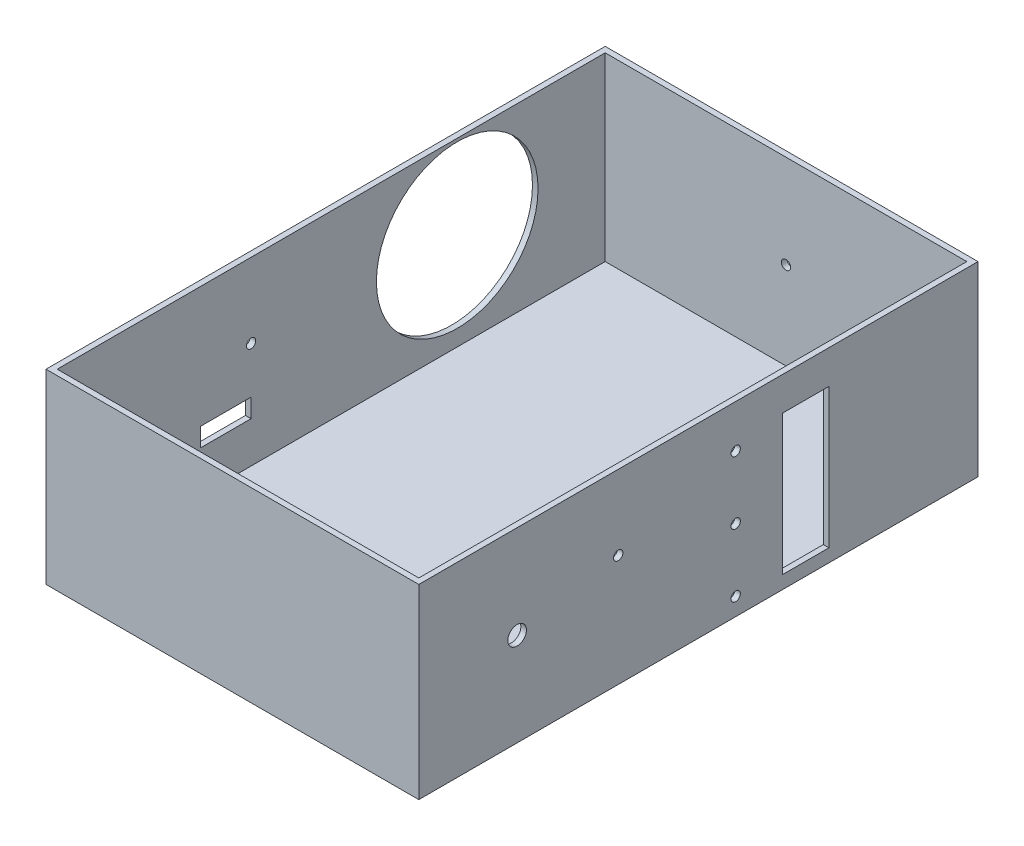
ISO-10303-21;
HEADER;
FILE_DESCRIPTION(('STEP AP214'),'2;1');
FILE_NAME('part.step','',(''),(''),'','','');
FILE_SCHEMA(('AUTOMOTIVE_DESIGN { 1 0 10303 214 1 1 1 1 }'));
ENDSEC;
DATA;
#1=APPLICATION_CONTEXT('core data for automotive mechanical design processes');
#2=APPLICATION_PROTOCOL_DEFINITION('international standard','automotive_design',2000,#1);
#3=PRODUCT_CONTEXT('',#1,'mechanical');
#4=PRODUCT('Part','Part','',(#3));
#5=PRODUCT_RELATED_PRODUCT_CATEGORY('part','',(#4));
#6=PRODUCT_DEFINITION_FORMATION('','',#4);
#7=PRODUCT_DEFINITION_CONTEXT('part definition',#1,'design');
#8=PRODUCT_DEFINITION('design','',#6,#7);
#9=PRODUCT_DEFINITION_SHAPE('','',#8);
#10=(LENGTH_UNIT() NAMED_UNIT(*) SI_UNIT(.MILLI.,.METRE.));
#11=(NAMED_UNIT(*) PLANE_ANGLE_UNIT() SI_UNIT($,.RADIAN.));
#12=(NAMED_UNIT(*) SI_UNIT($,.STERADIAN.) SOLID_ANGLE_UNIT());
#13=UNCERTAINTY_MEASURE_WITH_UNIT(LENGTH_MEASURE(1.E-05),#10,'distance_accuracy_value','');
#14=(GEOMETRIC_REPRESENTATION_CONTEXT(3) GLOBAL_UNCERTAINTY_ASSIGNED_CONTEXT((#13)) GLOBAL_UNIT_ASSIGNED_CONTEXT((#10,
#11,#12)) REPRESENTATION_CONTEXT('',''));
#15=CARTESIAN_POINT('',(0.,0.,0.));
#16=DIRECTION('',(0.,0.,1.));
#17=DIRECTION('',(1.,0.,0.));
#18=AXIS2_PLACEMENT_3D('',#15,#16,#17);
#19=CARTESIAN_POINT('',(-100.,50.,150.));
#20=DIRECTION('',(1.,0.,0.));
#21=DIRECTION('',(0.,0.,-1.));
#22=AXIS2_PLACEMENT_3D('',#19,#20,#21);
#23=PLANE('',#22);
#24=CARTESIAN_POINT('',(-100.,5.00000000000006,-67.6200595670859));
#25=DIRECTION('',(-1.,0.,0.));
#26=DIRECTION('',(0.,0.,1.));
#27=AXIS2_PLACEMENT_3D('',#24,#25,#26);
#28=CIRCLE('',#27,43.3583016473292);
#29=CARTESIAN_POINT('',(-100.,5.00000000000006,-24.2617579197568));
#30=VERTEX_POINT('',#29);
#31=EDGE_CURVE('E345',#30,#30,#28,.T.);
#32=ORIENTED_EDGE('',*,*,#31,.F.);
#33=EDGE_LOOP('',(#32));
#34=FACE_BOUND('',#33,.T.);
#35=CARTESIAN_POINT('',(-100.,10.,43.));
#36=DIRECTION('',(-1.,0.,0.));
#37=DIRECTION('',(0.,0.,1.));
#38=AXIS2_PLACEMENT_3D('',#35,#36,#37);
#39=CIRCLE('',#38,2.50000000000001);
#40=CARTESIAN_POINT('',(-100.,10.,45.5));
#41=VERTEX_POINT('',#40);
#42=EDGE_CURVE('E190',#41,#41,#39,.T.);
#43=ORIENTED_EDGE('',*,*,#42,.F.);
#44=EDGE_LOOP('',(#43));
#45=FACE_BOUND('',#44,.T.);
#46=DIRECTION('',(0.,0.,-1.));
#47=VECTOR('',#46,1.);
#48=CARTESIAN_POINT('',(-100.,-15.,43.));
#49=LINE('',#48,#47);
#50=CARTESIAN_POINT('',(-100.,-15.,70.));
#51=VERTEX_POINT('',#50);
#52=CARTESIAN_POINT('',(-100.,-15.,43.));
#53=VERTEX_POINT('',#52);
#54=EDGE_CURVE('E199',#51,#53,#49,.T.);
#55=ORIENTED_EDGE('',*,*,#54,.F.);
#56=DIRECTION('',(0.,1.,0.));
#57=VECTOR('',#56,1.);
#58=CARTESIAN_POINT('',(-100.,-15.,70.));
#59=LINE('',#58,#57);
#60=CARTESIAN_POINT('',(-100.,-25.,70.));
#61=VERTEX_POINT('',#60);
#62=EDGE_CURVE('E197',#61,#51,#59,.T.);
#63=ORIENTED_EDGE('',*,*,#62,.F.);
#64=DIRECTION('',(0.,0.,1.));
#65=VECTOR('',#64,1.);
#66=CARTESIAN_POINT('',(-100.,-25.,43.));
#67=LINE('',#66,#65);
#68=CARTESIAN_POINT('',(-100.,-25.,43.));
#69=VERTEX_POINT('',#68);
#70=EDGE_CURVE('E205',#69,#61,#67,.T.);
#71=ORIENTED_EDGE('',*,*,#70,.F.);
#72=DIRECTION('',(0.,-1.,0.));
#73=VECTOR('',#72,1.);
#74=CARTESIAN_POINT('',(-100.,-15.,43.));
#75=LINE('',#74,#73);
#76=EDGE_CURVE('E202',#53,#69,#75,.T.);
#77=ORIENTED_EDGE('',*,*,#76,.F.);
#78=EDGE_LOOP('',(#55,#63,#71,#77));
#79=FACE_BOUND('',#78,.T.);
#80=DIRECTION('',(0.,-1.,0.));
#81=VECTOR('',#80,1.);
#82=CARTESIAN_POINT('',(-100.,50.,-150.));
#83=LINE('',#82,#81);
#84=CARTESIAN_POINT('',(-100.,50.,-150.));
#85=VERTEX_POINT('',#84);
#86=CARTESIAN_POINT('',(-100.,-50.,-150.));
#87=VERTEX_POINT('',#86);
#88=EDGE_CURVE('E251',#85,#87,#83,.T.);
#89=ORIENTED_EDGE('',*,*,#88,.T.);
#90=DIRECTION('',(0.,0.,-1.));
#91=VECTOR('',#90,1.);
#92=CARTESIAN_POINT('',(-100.,-50.,150.));
#93=LINE('',#92,#91);
#94=CARTESIAN_POINT('',(-100.,-50.,150.));
#95=VERTEX_POINT('',#94);
#96=EDGE_CURVE('E284',#95,#87,#93,.T.);
#97=ORIENTED_EDGE('',*,*,#96,.F.);
#98=DIRECTION('',(0.,-1.,0.));
#99=VECTOR('',#98,1.);
#100=CARTESIAN_POINT('',(-100.,50.,150.));
#101=LINE('',#100,#99);
#102=CARTESIAN_POINT('',(-100.,50.,150.));
#103=VERTEX_POINT('',#102);
#104=EDGE_CURVE('E258',#103,#95,#101,.T.);
#105=ORIENTED_EDGE('',*,*,#104,.F.);
#106=DIRECTION('',(0.,0.,-1.));
#107=VECTOR('',#106,1.);
#108=CARTESIAN_POINT('',(-100.,50.,150.));
#109=LINE('',#108,#107);
#110=EDGE_CURVE('E268',#103,#85,#109,.T.);
#111=ORIENTED_EDGE('',*,*,#110,.T.);
#112=EDGE_LOOP('',(#89,#97,#105,#111));
#113=FACE_BOUND('',#112,.T.);
#114=ADVANCED_FACE('F35',(#34,#45,#79,#113),#23,.F.);
#115=CARTESIAN_POINT('',(-100.,-50.,150.));
#116=DIRECTION('',(0.,1.,0.));
#117=DIRECTION('',(0.,0.,1.));
#118=AXIS2_PLACEMENT_3D('',#115,#116,#117);
#119=PLANE('',#118);
#120=DIRECTION('',(1.,0.,0.));
#121=VECTOR('',#120,1.);
#122=CARTESIAN_POINT('',(-100.,-50.,-150.));
#123=LINE('',#122,#121);
#124=CARTESIAN_POINT('',(100.,-50.,-150.));
#125=VERTEX_POINT('',#124);
#126=EDGE_CURVE('E271',#87,#125,#123,.T.);
#127=ORIENTED_EDGE('',*,*,#126,.T.);
#128=DIRECTION('',(0.,0.,-1.));
#129=VECTOR('',#128,1.);
#130=CARTESIAN_POINT('',(100.,-50.,150.));
#131=LINE('',#130,#129);
#132=CARTESIAN_POINT('',(100.,-50.,150.));
#133=VERTEX_POINT('',#132);
#134=EDGE_CURVE('E281',#133,#125,#131,.T.);
#135=ORIENTED_EDGE('',*,*,#134,.F.);
#136=DIRECTION('',(1.,0.,0.));
#137=VECTOR('',#136,1.);
#138=CARTESIAN_POINT('',(-100.,-50.,150.));
#139=LINE('',#138,#137);
#140=EDGE_CURVE('E261',#95,#133,#139,.T.);
#141=ORIENTED_EDGE('',*,*,#140,.F.);
#142=ORIENTED_EDGE('',*,*,#96,.T.);
#143=EDGE_LOOP('',(#127,#135,#141,#142));
#144=FACE_BOUND('',#143,.T.);
#145=ADVANCED_FACE('F336',(#144),#119,.F.);
#146=CARTESIAN_POINT('',(100.,50.,150.));
#147=DIRECTION('',(-1.,0.,0.));
#148=DIRECTION('',(0.,0.,1.));
#149=AXIS2_PLACEMENT_3D('',#146,#147,#148);
#150=PLANE('',#149);
#151=DIRECTION('',(0.,0.,1.));
#152=VECTOR('',#151,1.);
#153=CARTESIAN_POINT('',(100.,32.,-45.));
#154=LINE('',#153,#152);
#155=CARTESIAN_POINT('',(100.,32.,-70.));
#156=VERTEX_POINT('',#155);
#157=CARTESIAN_POINT('',(100.,32.,-45.));
#158=VERTEX_POINT('',#157);
#159=EDGE_CURVE('E160',#156,#158,#154,.T.);
#160=ORIENTED_EDGE('',*,*,#159,.F.);
#161=DIRECTION('',(0.,1.,0.));
#162=VECTOR('',#161,1.);
#163=CARTESIAN_POINT('',(100.,32.,-70.));
#164=LINE('',#163,#162);
#165=CARTESIAN_POINT('',(100.,-43.,-70.));
#166=VERTEX_POINT('',#165);
#167=EDGE_CURVE('E50',#166,#156,#164,.T.);
#168=ORIENTED_EDGE('',*,*,#167,.F.);
#169=DIRECTION('',(0.,0.,-1.));
#170=VECTOR('',#169,1.);
#171=CARTESIAN_POINT('',(100.,-43.,-45.));
#172=LINE('',#171,#170);
#173=CARTESIAN_POINT('',(100.,-43.,-45.));
#174=VERTEX_POINT('',#173);
#175=EDGE_CURVE('E167',#174,#166,#172,.T.);
#176=ORIENTED_EDGE('',*,*,#175,.F.);
#177=DIRECTION('',(0.,-1.,0.));
#178=VECTOR('',#177,1.);
#179=CARTESIAN_POINT('',(100.,32.,-45.));
#180=LINE('',#179,#178);
#181=EDGE_CURVE('E151',#158,#174,#180,.T.);
#182=ORIENTED_EDGE('',*,*,#181,.F.);
#183=EDGE_LOOP('',(#160,#168,#176,#182));
#184=FACE_BOUND('',#183,.T.);
#185=CARTESIAN_POINT('',(100.,27.,-20.));
#186=DIRECTION('',(1.,0.,0.));
#187=DIRECTION('',(0.,0.,-1.));
#188=AXIS2_PLACEMENT_3D('',#185,#186,#187);
#189=CIRCLE('',#188,2.49999999999999);
#190=CARTESIAN_POINT('',(100.,27.,-22.5));
#191=VERTEX_POINT('',#190);
#192=EDGE_CURVE('E177',#191,#191,#189,.T.);
#193=ORIENTED_EDGE('',*,*,#192,.F.);
#194=EDGE_LOOP('',(#193));
#195=FACE_BOUND('',#194,.T.);
#196=CARTESIAN_POINT('',(100.,-6.75000000000002,-20.));
#197=DIRECTION('',(1.,0.,0.));
#198=DIRECTION('',(0.,0.,-1.));
#199=AXIS2_PLACEMENT_3D('',#196,#197,#198);
#200=CIRCLE('',#199,2.49999999999999);
#201=CARTESIAN_POINT('',(100.,-6.75000000000002,-22.5));
#202=VERTEX_POINT('',#201);
#203=EDGE_CURVE('E180',#202,#202,#200,.T.);
#204=ORIENTED_EDGE('',*,*,#203,.F.);
#205=EDGE_LOOP('',(#204));
#206=FACE_BOUND('',#205,.T.);
#207=CARTESIAN_POINT('',(100.,-40.5,-20.));
#208=DIRECTION('',(1.,0.,0.));
#209=DIRECTION('',(0.,0.,-1.));
#210=AXIS2_PLACEMENT_3D('',#207,#208,#209);
#211=CIRCLE('',#210,2.5);
#212=CARTESIAN_POINT('',(100.,-40.5,-22.5));
#213=VERTEX_POINT('',#212);
#214=EDGE_CURVE('E183',#213,#213,#211,.T.);
#215=ORIENTED_EDGE('',*,*,#214,.F.);
#216=EDGE_LOOP('',(#215));
#217=FACE_BOUND('',#216,.T.);
#218=CARTESIAN_POINT('',(100.,10.,43.));
#219=DIRECTION('',(-1.,0.,0.));
#220=DIRECTION('',(0.,0.,1.));
#221=AXIS2_PLACEMENT_3D('',#218,#219,#220);
#222=CIRCLE('',#221,2.50000000000001);
#223=CARTESIAN_POINT('',(100.,10.,45.5));
#224=VERTEX_POINT('',#223);
#225=EDGE_CURVE('E186',#224,#224,#222,.T.);
#226=ORIENTED_EDGE('',*,*,#225,.T.);
#227=EDGE_LOOP('',(#226));
#228=FACE_BOUND('',#227,.T.);
#229=CARTESIAN_POINT('',(100.,0.,97.2561035240871));
#230=DIRECTION('',(1.,0.,0.));
#231=DIRECTION('',(0.,0.,-1.));
#232=AXIS2_PLACEMENT_3D('',#229,#230,#231);
#233=CIRCLE('',#232,5.);
#234=CARTESIAN_POINT('',(100.,0.,92.2561035240871));
#235=VERTEX_POINT('',#234);
#236=EDGE_CURVE('E221',#235,#235,#233,.T.);
#237=ORIENTED_EDGE('',*,*,#236,.F.);
#238=EDGE_LOOP('',(#237));
#239=FACE_BOUND('',#238,.T.);
#240=DIRECTION('',(0.,1.,0.));
#241=VECTOR('',#240,1.);
#242=CARTESIAN_POINT('',(100.,50.,-150.));
#243=LINE('',#242,#241);
#244=CARTESIAN_POINT('',(100.,50.,-150.));
#245=VERTEX_POINT('',#244);
#246=EDGE_CURVE('E273',#125,#245,#243,.T.);
#247=ORIENTED_EDGE('',*,*,#246,.T.);
#248=DIRECTION('',(0.,0.,-1.));
#249=VECTOR('',#248,1.);
#250=CARTESIAN_POINT('',(100.,50.,150.));
#251=LINE('',#250,#249);
#252=CARTESIAN_POINT('',(100.,50.,150.));
#253=VERTEX_POINT('',#252);
#254=EDGE_CURVE('E278',#253,#245,#251,.T.);
#255=ORIENTED_EDGE('',*,*,#254,.F.);
#256=DIRECTION('',(0.,1.,0.));
#257=VECTOR('',#256,1.);
#258=CARTESIAN_POINT('',(100.,50.,150.));
#259=LINE('',#258,#257);
#260=EDGE_CURVE('E264',#133,#253,#259,.T.);
#261=ORIENTED_EDGE('',*,*,#260,.F.);
#262=ORIENTED_EDGE('',*,*,#134,.T.);
#263=EDGE_LOOP('',(#247,#255,#261,#262));
#264=FACE_BOUND('',#263,.T.);
#265=ADVANCED_FACE('F164',(#184,#195,#206,#217,#228,#239,#264),#150,.F.);
#266=CARTESIAN_POINT('',(-100.,50.,150.));
#267=DIRECTION('',(0.,-1.,0.));
#268=DIRECTION('',(0.,0.,-1.));
#269=AXIS2_PLACEMENT_3D('',#266,#267,#268);
#270=PLANE('',#269);
#271=DIRECTION('',(1.,0.,0.));
#272=VECTOR('',#271,1.);
#273=CARTESIAN_POINT('',(-97.,50.,147.));
#274=LINE('',#273,#272);
#275=CARTESIAN_POINT('',(-97.,50.,147.));
#276=VERTEX_POINT('',#275);
#277=CARTESIAN_POINT('',(97.,50.,147.));
#278=VERTEX_POINT('',#277);
#279=EDGE_CURVE('E241',#276,#278,#274,.T.);
#280=ORIENTED_EDGE('',*,*,#279,.F.);
#281=DIRECTION('',(0.,0.,1.));
#282=VECTOR('',#281,1.);
#283=CARTESIAN_POINT('',(-97.,50.,-147.));
#284=LINE('',#283,#282);
#285=CARTESIAN_POINT('',(-97.,50.,-147.));
#286=VERTEX_POINT('',#285);
#287=EDGE_CURVE('E239',#286,#276,#284,.T.);
#288=ORIENTED_EDGE('',*,*,#287,.F.);
#289=DIRECTION('',(-1.,0.,0.));
#290=VECTOR('',#289,1.);
#291=CARTESIAN_POINT('',(-97.,50.,-147.));
#292=LINE('',#291,#290);
#293=CARTESIAN_POINT('',(97.,50.,-147.));
#294=VERTEX_POINT('',#293);
#295=EDGE_CURVE('E229',#294,#286,#292,.T.);
#296=ORIENTED_EDGE('',*,*,#295,.F.);
#297=DIRECTION('',(0.,0.,-1.));
#298=VECTOR('',#297,1.);
#299=CARTESIAN_POINT('',(97.,50.,-147.));
#300=LINE('',#299,#298);
#301=EDGE_CURVE('E244',#278,#294,#300,.T.);
#302=ORIENTED_EDGE('',*,*,#301,.F.);
#303=EDGE_LOOP('',(#280,#288,#296,#302));
#304=FACE_BOUND('',#303,.T.);
#305=DIRECTION('',(-1.,0.,0.));
#306=VECTOR('',#305,1.);
#307=CARTESIAN_POINT('',(-100.,50.,-150.));
#308=LINE('',#307,#306);
#309=EDGE_CURVE('E262',#245,#85,#308,.T.);
#310=ORIENTED_EDGE('',*,*,#309,.T.);
#311=ORIENTED_EDGE('',*,*,#110,.F.);
#312=DIRECTION('',(-1.,0.,0.));
#313=VECTOR('',#312,1.);
#314=CARTESIAN_POINT('',(-100.,50.,150.));
#315=LINE('',#314,#313);
#316=EDGE_CURVE('E266',#253,#103,#315,.T.);
#317=ORIENTED_EDGE('',*,*,#316,.F.);
#318=ORIENTED_EDGE('',*,*,#254,.T.);
#319=EDGE_LOOP('',(#310,#311,#317,#318));
#320=FACE_BOUND('',#319,.T.);
#321=ADVANCED_FACE('F367',(#304,#320),#270,.F.);
#322=CARTESIAN_POINT('',(0.,0.,150.));
#323=DIRECTION('',(0.,0.,1.));
#324=DIRECTION('',(1.,0.,0.));
#325=AXIS2_PLACEMENT_3D('',#322,#323,#324);
#326=PLANE('',#325);
#327=ORIENTED_EDGE('',*,*,#104,.T.);
#328=ORIENTED_EDGE('',*,*,#140,.T.);
#329=ORIENTED_EDGE('',*,*,#260,.T.);
#330=ORIENTED_EDGE('',*,*,#316,.T.);
#331=EDGE_LOOP('',(#327,#328,#329,#330));
#332=FACE_BOUND('',#331,.T.);
#333=ADVANCED_FACE('F363',(#332),#326,.T.);
#334=CARTESIAN_POINT('',(0.,0.,-150.));
#335=DIRECTION('',(0.,0.,1.));
#336=DIRECTION('',(1.,0.,0.));
#337=AXIS2_PLACEMENT_3D('',#334,#335,#336);
#338=PLANE('',#337);
#339=CARTESIAN_POINT('',(0.,0.,-150.));
#340=DIRECTION('',(0.,0.,-1.));
#341=DIRECTION('',(-1.,0.,0.));
#342=AXIS2_PLACEMENT_3D('',#339,#340,#341);
#343=CIRCLE('',#342,2.5);
#344=CARTESIAN_POINT('',(-2.5,0.,-150.));
#345=VERTEX_POINT('',#344);
#346=EDGE_CURVE('E211',#345,#345,#343,.T.);
#347=ORIENTED_EDGE('',*,*,#346,.F.);
#348=EDGE_LOOP('',(#347));
#349=FACE_BOUND('',#348,.T.);
#350=ORIENTED_EDGE('',*,*,#88,.F.);
#351=ORIENTED_EDGE('',*,*,#309,.F.);
#352=ORIENTED_EDGE('',*,*,#246,.F.);
#353=ORIENTED_EDGE('',*,*,#126,.F.);
#354=EDGE_LOOP('',(#350,#351,#352,#353));
#355=FACE_BOUND('',#354,.T.);
#356=ADVANCED_FACE('F358',(#349,#355),#338,.F.);
#357=CARTESIAN_POINT('',(-97.,-47.,-147.));
#358=DIRECTION('',(-1.,0.,0.));
#359=DIRECTION('',(0.,0.,1.));
#360=AXIS2_PLACEMENT_3D('',#357,#358,#359);
#361=PLANE('',#360);
#362=CARTESIAN_POINT('',(-97.,5.00000000000006,-67.6200595670859));
#363=DIRECTION('',(-1.,0.,0.));
#364=DIRECTION('',(0.,0.,1.));
#365=AXIS2_PLACEMENT_3D('',#362,#363,#364);
#366=CIRCLE('',#365,43.3583016473292);
#367=CARTESIAN_POINT('',(-97.,5.00000000000006,-24.2617579197568));
#368=VERTEX_POINT('',#367);
#369=EDGE_CURVE('E38',#368,#368,#366,.T.);
#370=ORIENTED_EDGE('',*,*,#369,.T.);
#371=EDGE_LOOP('',(#370));
#372=FACE_BOUND('',#371,.T.);
#373=CARTESIAN_POINT('',(-97.,10.,43.));
#374=DIRECTION('',(-1.,0.,0.));
#375=DIRECTION('',(0.,0.,1.));
#376=AXIS2_PLACEMENT_3D('',#373,#374,#375);
#377=CIRCLE('',#376,2.50000000000001);
#378=CARTESIAN_POINT('',(-97.,10.,45.5));
#379=VERTEX_POINT('',#378);
#380=EDGE_CURVE('E194',#379,#379,#377,.T.);
#381=ORIENTED_EDGE('',*,*,#380,.T.);
#382=EDGE_LOOP('',(#381));
#383=FACE_BOUND('',#382,.T.);
#384=DIRECTION('',(0.,0.,1.));
#385=VECTOR('',#384,1.);
#386=CARTESIAN_POINT('',(-97.,-25.,-147.));
#387=LINE('',#386,#385);
#388=CARTESIAN_POINT('',(-97.,-25.,43.));
#389=VERTEX_POINT('',#388);
#390=CARTESIAN_POINT('',(-97.,-25.,70.));
#391=VERTEX_POINT('',#390);
#392=EDGE_CURVE('E297',#389,#391,#387,.T.);
#393=ORIENTED_EDGE('',*,*,#392,.T.);
#394=DIRECTION('',(0.,1.,0.));
#395=VECTOR('',#394,1.);
#396=CARTESIAN_POINT('',(-97.,-47.,70.));
#397=LINE('',#396,#395);
#398=CARTESIAN_POINT('',(-97.,-15.,70.));
#399=VERTEX_POINT('',#398);
#400=EDGE_CURVE('E300',#391,#399,#397,.T.);
#401=ORIENTED_EDGE('',*,*,#400,.T.);
#402=DIRECTION('',(0.,0.,-1.));
#403=VECTOR('',#402,1.);
#404=CARTESIAN_POINT('',(-97.,-15.,-147.));
#405=LINE('',#404,#403);
#406=CARTESIAN_POINT('',(-97.,-15.,43.));
#407=VERTEX_POINT('',#406);
#408=EDGE_CURVE('E287',#399,#407,#405,.T.);
#409=ORIENTED_EDGE('',*,*,#408,.T.);
#410=DIRECTION('',(0.,-1.,0.));
#411=VECTOR('',#410,1.);
#412=CARTESIAN_POINT('',(-97.,-47.,43.));
#413=LINE('',#412,#411);
#414=EDGE_CURVE('E294',#407,#389,#413,.T.);
#415=ORIENTED_EDGE('',*,*,#414,.T.);
#416=EDGE_LOOP('',(#393,#401,#409,#415));
#417=FACE_BOUND('',#416,.T.);
#418=ORIENTED_EDGE('',*,*,#287,.T.);
#419=DIRECTION('',(0.,1.,0.));
#420=VECTOR('',#419,1.);
#421=CARTESIAN_POINT('',(-97.,-47.,147.));
#422=LINE('',#421,#420);
#423=CARTESIAN_POINT('',(-97.,-47.,147.));
#424=VERTEX_POINT('',#423);
#425=EDGE_CURVE('E238',#424,#276,#422,.T.);
#426=ORIENTED_EDGE('',*,*,#425,.F.);
#427=DIRECTION('',(0.,0.,1.));
#428=VECTOR('',#427,1.);
#429=CARTESIAN_POINT('',(-97.,-47.,-147.));
#430=LINE('',#429,#428);
#431=CARTESIAN_POINT('',(-97.,-47.,-147.));
#432=VERTEX_POINT('',#431);
#433=EDGE_CURVE('E225',#432,#424,#430,.T.);
#434=ORIENTED_EDGE('',*,*,#433,.F.);
#435=DIRECTION('',(0.,1.,0.));
#436=VECTOR('',#435,1.);
#437=CARTESIAN_POINT('',(-97.,-47.,-147.));
#438=LINE('',#437,#436);
#439=EDGE_CURVE('E249',#432,#286,#438,.T.);
#440=ORIENTED_EDGE('',*,*,#439,.T.);
#441=EDGE_LOOP('',(#418,#426,#434,#440));
#442=FACE_BOUND('',#441,.T.);
#443=ADVANCED_FACE('F379',(#372,#383,#417,#442),#361,.F.);
#444=CARTESIAN_POINT('',(-97.,-47.,-147.));
#445=DIRECTION('',(0.,0.,-1.));
#446=DIRECTION('',(-1.,0.,0.));
#447=AXIS2_PLACEMENT_3D('',#444,#445,#446);
#448=PLANE('',#447);
#449=CARTESIAN_POINT('',(0.,0.,-147.));
#450=DIRECTION('',(0.,0.,-1.));
#451=DIRECTION('',(-1.,0.,0.));
#452=AXIS2_PLACEMENT_3D('',#449,#450,#451);
#453=CIRCLE('',#452,2.5);
#454=CARTESIAN_POINT('',(-2.5,0.,-147.));
#455=VERTEX_POINT('',#454);
#456=EDGE_CURVE('E220',#455,#455,#453,.T.);
#457=ORIENTED_EDGE('',*,*,#456,.T.);
#458=EDGE_LOOP('',(#457));
#459=FACE_BOUND('',#458,.T.);
#460=ORIENTED_EDGE('',*,*,#295,.T.);
#461=ORIENTED_EDGE('',*,*,#439,.F.);
#462=DIRECTION('',(-1.,0.,0.));
#463=VECTOR('',#462,1.);
#464=CARTESIAN_POINT('',(-97.,-47.,-147.));
#465=LINE('',#464,#463);
#466=CARTESIAN_POINT('',(97.,-47.,-147.));
#467=VERTEX_POINT('',#466);
#468=EDGE_CURVE('E235',#467,#432,#465,.T.);
#469=ORIENTED_EDGE('',*,*,#468,.F.);
#470=DIRECTION('',(0.,1.,0.));
#471=VECTOR('',#470,1.);
#472=CARTESIAN_POINT('',(97.,-47.,-147.));
#473=LINE('',#472,#471);
#474=EDGE_CURVE('E252',#467,#294,#473,.T.);
#475=ORIENTED_EDGE('',*,*,#474,.T.);
#476=EDGE_LOOP('',(#460,#461,#469,#475));
#477=FACE_BOUND('',#476,.T.);
#478=ADVANCED_FACE('F385',(#459,#477),#448,.F.);
#479=CARTESIAN_POINT('',(97.,-47.,-147.));
#480=DIRECTION('',(1.,0.,0.));
#481=DIRECTION('',(0.,0.,-1.));
#482=AXIS2_PLACEMENT_3D('',#479,#480,#481);
#483=PLANE('',#482);
#484=DIRECTION('',(0.,0.,-1.));
#485=VECTOR('',#484,1.);
#486=CARTESIAN_POINT('',(97.,-43.,-147.));
#487=LINE('',#486,#485);
#488=CARTESIAN_POINT('',(97.,-43.,-45.));
#489=VERTEX_POINT('',#488);
#490=CARTESIAN_POINT('',(97.,-43.,-70.));
#491=VERTEX_POINT('',#490);
#492=EDGE_CURVE('E43',#489,#491,#487,.T.);
#493=ORIENTED_EDGE('',*,*,#492,.T.);
#494=DIRECTION('',(0.,1.,0.));
#495=VECTOR('',#494,1.);
#496=CARTESIAN_POINT('',(97.,-47.,-70.));
#497=LINE('',#496,#495);
#498=CARTESIAN_POINT('',(97.,32.,-70.));
#499=VERTEX_POINT('',#498);
#500=EDGE_CURVE('E11',#491,#499,#497,.T.);
#501=ORIENTED_EDGE('',*,*,#500,.T.);
#502=DIRECTION('',(0.,0.,1.));
#503=VECTOR('',#502,1.);
#504=CARTESIAN_POINT('',(97.,32.,-147.));
#505=LINE('',#504,#503);
#506=CARTESIAN_POINT('',(97.,32.,-45.));
#507=VERTEX_POINT('',#506);
#508=EDGE_CURVE('E303',#499,#507,#505,.T.);
#509=ORIENTED_EDGE('',*,*,#508,.T.);
#510=DIRECTION('',(0.,-1.,0.));
#511=VECTOR('',#510,1.);
#512=CARTESIAN_POINT('',(97.,-47.,-45.));
#513=LINE('',#512,#511);
#514=EDGE_CURVE('E154',#507,#489,#513,.T.);
#515=ORIENTED_EDGE('',*,*,#514,.T.);
#516=EDGE_LOOP('',(#493,#501,#509,#515));
#517=FACE_BOUND('',#516,.T.);
#518=CARTESIAN_POINT('',(97.,27.,-20.));
#519=DIRECTION('',(1.,0.,0.));
#520=DIRECTION('',(0.,0.,-1.));
#521=AXIS2_PLACEMENT_3D('',#518,#519,#520);
#522=CIRCLE('',#521,2.49999999999999);
#523=CARTESIAN_POINT('',(97.,27.,-22.5));
#524=VERTEX_POINT('',#523);
#525=EDGE_CURVE('E193',#524,#524,#522,.T.);
#526=ORIENTED_EDGE('',*,*,#525,.T.);
#527=EDGE_LOOP('',(#526));
#528=FACE_BOUND('',#527,.T.);
#529=CARTESIAN_POINT('',(97.,-6.75000000000002,-20.));
#530=DIRECTION('',(1.,0.,0.));
#531=DIRECTION('',(0.,0.,-1.));
#532=AXIS2_PLACEMENT_3D('',#529,#530,#531);
#533=CIRCLE('',#532,2.49999999999999);
#534=CARTESIAN_POINT('',(97.,-6.75000000000002,-22.5));
#535=VERTEX_POINT('',#534);
#536=EDGE_CURVE('E308',#535,#535,#533,.T.);
#537=ORIENTED_EDGE('',*,*,#536,.T.);
#538=EDGE_LOOP('',(#537));
#539=FACE_BOUND('',#538,.T.);
#540=CARTESIAN_POINT('',(97.,-40.5,-20.));
#541=DIRECTION('',(1.,0.,0.));
#542=DIRECTION('',(0.,0.,-1.));
#543=AXIS2_PLACEMENT_3D('',#540,#541,#542);
#544=CIRCLE('',#543,2.5);
#545=CARTESIAN_POINT('',(97.,-40.5,-22.5));
#546=VERTEX_POINT('',#545);
#547=EDGE_CURVE('E174',#546,#546,#544,.T.);
#548=ORIENTED_EDGE('',*,*,#547,.T.);
#549=EDGE_LOOP('',(#548));
#550=FACE_BOUND('',#549,.T.);
#551=CARTESIAN_POINT('',(97.,10.,43.));
#552=DIRECTION('',(1.,0.,0.));
#553=DIRECTION('',(0.,0.,-1.));
#554=AXIS2_PLACEMENT_3D('',#551,#552,#553);
#555=CIRCLE('',#554,2.50000000000001);
#556=CARTESIAN_POINT('',(97.,10.,40.5));
#557=VERTEX_POINT('',#556);
#558=EDGE_CURVE('E189',#557,#557,#555,.T.);
#559=ORIENTED_EDGE('',*,*,#558,.T.);
#560=EDGE_LOOP('',(#559));
#561=FACE_BOUND('',#560,.T.);
#562=CARTESIAN_POINT('',(97.,0.,97.2561035240871));
#563=DIRECTION('',(1.,0.,0.));
#564=DIRECTION('',(0.,0.,-1.));
#565=AXIS2_PLACEMENT_3D('',#562,#563,#564);
#566=CIRCLE('',#565,5.);
#567=CARTESIAN_POINT('',(97.,0.,92.2561035240871));
#568=VERTEX_POINT('',#567);
#569=EDGE_CURVE('E224',#568,#568,#566,.T.);
#570=ORIENTED_EDGE('',*,*,#569,.T.);
#571=EDGE_LOOP('',(#570));
#572=FACE_BOUND('',#571,.T.);
#573=ORIENTED_EDGE('',*,*,#301,.T.);
#574=ORIENTED_EDGE('',*,*,#474,.F.);
#575=DIRECTION('',(0.,0.,-1.));
#576=VECTOR('',#575,1.);
#577=CARTESIAN_POINT('',(97.,-47.,-147.));
#578=LINE('',#577,#576);
#579=CARTESIAN_POINT('',(97.,-47.,147.));
#580=VERTEX_POINT('',#579);
#581=EDGE_CURVE('E232',#580,#467,#578,.T.);
#582=ORIENTED_EDGE('',*,*,#581,.F.);
#583=DIRECTION('',(0.,1.,0.));
#584=VECTOR('',#583,1.);
#585=CARTESIAN_POINT('',(97.,-47.,147.));
#586=LINE('',#585,#584);
#587=EDGE_CURVE('E254',#580,#278,#586,.T.);
#588=ORIENTED_EDGE('',*,*,#587,.T.);
#589=EDGE_LOOP('',(#573,#574,#582,#588));
#590=FACE_BOUND('',#589,.T.);
#591=ADVANCED_FACE('F317',(#517,#528,#539,#550,#561,#572,#590),#483,.F.);
#592=CARTESIAN_POINT('',(-97.,-47.,147.));
#593=DIRECTION('',(0.,0.,1.));
#594=DIRECTION('',(1.,0.,0.));
#595=AXIS2_PLACEMENT_3D('',#592,#593,#594);
#596=PLANE('',#595);
#597=ORIENTED_EDGE('',*,*,#279,.T.);
#598=ORIENTED_EDGE('',*,*,#587,.F.);
#599=DIRECTION('',(1.,0.,0.));
#600=VECTOR('',#599,1.);
#601=CARTESIAN_POINT('',(-97.,-47.,147.));
#602=LINE('',#601,#600);
#603=EDGE_CURVE('E228',#424,#580,#602,.T.);
#604=ORIENTED_EDGE('',*,*,#603,.F.);
#605=ORIENTED_EDGE('',*,*,#425,.T.);
#606=EDGE_LOOP('',(#597,#598,#604,#605));
#607=FACE_BOUND('',#606,.T.);
#608=ADVANCED_FACE('F387',(#607),#596,.F.);
#609=CARTESIAN_POINT('',(0.,-47.,0.));
#610=DIRECTION('',(0.,1.,0.));
#611=DIRECTION('',(0.,0.,1.));
#612=AXIS2_PLACEMENT_3D('',#609,#610,#611);
#613=PLANE('',#612);
#614=ORIENTED_EDGE('',*,*,#433,.T.);
#615=ORIENTED_EDGE('',*,*,#603,.T.);
#616=ORIENTED_EDGE('',*,*,#581,.T.);
#617=ORIENTED_EDGE('',*,*,#468,.T.);
#618=EDGE_LOOP('',(#614,#615,#616,#617));
#619=FACE_BOUND('',#618,.T.);
#620=ADVANCED_FACE('F390',(#619),#613,.T.);
#621=CARTESIAN_POINT('',(90.,0.,97.2561035240871));
#622=DIRECTION('',(1.,0.,0.));
#623=DIRECTION('',(0.,0.,-1.));
#624=AXIS2_PLACEMENT_3D('',#621,#622,#623);
#625=CYLINDRICAL_SURFACE('',#624,5.);
#626=ORIENTED_EDGE('',*,*,#236,.T.);
#627=EDGE_LOOP('',(#626));
#628=FACE_BOUND('',#627,.T.);
#629=ORIENTED_EDGE('',*,*,#569,.F.);
#630=EDGE_LOOP('',(#629));
#631=FACE_BOUND('',#630,.T.);
#632=ADVANCED_FACE('F399',(#628,#631),#625,.F.);
#633=CARTESIAN_POINT('',(0.,0.,-140.));
#634=DIRECTION('',(0.,0.,-1.));
#635=DIRECTION('',(-1.,0.,0.));
#636=AXIS2_PLACEMENT_3D('',#633,#634,#635);
#637=CYLINDRICAL_SURFACE('',#636,2.5);
#638=ORIENTED_EDGE('',*,*,#346,.T.);
#639=EDGE_LOOP('',(#638));
#640=FACE_BOUND('',#639,.T.);
#641=ORIENTED_EDGE('',*,*,#456,.F.);
#642=EDGE_LOOP('',(#641));
#643=FACE_BOUND('',#642,.T.);
#644=ADVANCED_FACE('F403',(#640,#643),#637,.F.);
#645=CARTESIAN_POINT('',(-90.,-15.,70.));
#646=DIRECTION('',(0.,0.,1.));
#647=DIRECTION('',(1.,0.,0.));
#648=AXIS2_PLACEMENT_3D('',#645,#646,#647);
#649=PLANE('',#648);
#650=DIRECTION('',(-1.,0.,0.));
#651=VECTOR('',#650,1.);
#652=CARTESIAN_POINT('',(-90.,-25.,70.));
#653=LINE('',#652,#651);
#654=EDGE_CURVE('E209',#391,#61,#653,.T.);
#655=ORIENTED_EDGE('',*,*,#654,.T.);
#656=ORIENTED_EDGE('',*,*,#62,.T.);
#657=DIRECTION('',(-1.,0.,0.));
#658=VECTOR('',#657,1.);
#659=CARTESIAN_POINT('',(-90.,-15.,70.));
#660=LINE('',#659,#658);
#661=EDGE_CURVE('E208',#399,#51,#660,.T.);
#662=ORIENTED_EDGE('',*,*,#661,.F.);
#663=ORIENTED_EDGE('',*,*,#400,.F.);
#664=EDGE_LOOP('',(#655,#656,#662,#663));
#665=FACE_BOUND('',#664,.T.);
#666=ADVANCED_FACE('F407',(#665),#649,.F.);
#667=CARTESIAN_POINT('',(-90.,-25.,43.));
#668=DIRECTION('',(0.,-1.,0.));
#669=DIRECTION('',(0.,0.,-1.));
#670=AXIS2_PLACEMENT_3D('',#667,#668,#669);
#671=PLANE('',#670);
#672=DIRECTION('',(-1.,0.,0.));
#673=VECTOR('',#672,1.);
#674=CARTESIAN_POINT('',(-90.,-25.,43.));
#675=LINE('',#674,#673);
#676=EDGE_CURVE('E212',#389,#69,#675,.T.);
#677=ORIENTED_EDGE('',*,*,#676,.T.);
#678=ORIENTED_EDGE('',*,*,#70,.T.);
#679=ORIENTED_EDGE('',*,*,#654,.F.);
#680=ORIENTED_EDGE('',*,*,#392,.F.);
#681=EDGE_LOOP('',(#677,#678,#679,#680));
#682=FACE_BOUND('',#681,.T.);
#683=ADVANCED_FACE('F411',(#682),#671,.F.);
#684=CARTESIAN_POINT('',(-90.,-15.,43.));
#685=DIRECTION('',(0.,0.,-1.));
#686=DIRECTION('',(-1.,0.,0.));
#687=AXIS2_PLACEMENT_3D('',#684,#685,#686);
#688=PLANE('',#687);
#689=DIRECTION('',(-1.,0.,0.));
#690=VECTOR('',#689,1.);
#691=CARTESIAN_POINT('',(-90.,-15.,43.));
#692=LINE('',#691,#690);
#693=EDGE_CURVE('E214',#407,#53,#692,.T.);
#694=ORIENTED_EDGE('',*,*,#693,.T.);
#695=ORIENTED_EDGE('',*,*,#76,.T.);
#696=ORIENTED_EDGE('',*,*,#676,.F.);
#697=ORIENTED_EDGE('',*,*,#414,.F.);
#698=EDGE_LOOP('',(#694,#695,#696,#697));
#699=FACE_BOUND('',#698,.T.);
#700=ADVANCED_FACE('F417',(#699),#688,.F.);
#701=CARTESIAN_POINT('',(-90.,-15.,43.));
#702=DIRECTION('',(0.,1.,0.));
#703=DIRECTION('',(0.,0.,1.));
#704=AXIS2_PLACEMENT_3D('',#701,#702,#703);
#705=PLANE('',#704);
#706=ORIENTED_EDGE('',*,*,#661,.T.);
#707=ORIENTED_EDGE('',*,*,#54,.T.);
#708=ORIENTED_EDGE('',*,*,#693,.F.);
#709=ORIENTED_EDGE('',*,*,#408,.F.);
#710=EDGE_LOOP('',(#706,#707,#708,#709));
#711=FACE_BOUND('',#710,.T.);
#712=ADVANCED_FACE('F413',(#711),#705,.F.);
#713=CARTESIAN_POINT('',(100.,10.,43.));
#714=DIRECTION('',(-1.,0.,0.));
#715=DIRECTION('',(0.,0.,1.));
#716=AXIS2_PLACEMENT_3D('',#713,#714,#715);
#717=CYLINDRICAL_SURFACE('',#716,2.50000000000001);
#718=ORIENTED_EDGE('',*,*,#225,.F.);
#719=EDGE_LOOP('',(#718));
#720=FACE_BOUND('',#719,.T.);
#721=ORIENTED_EDGE('',*,*,#558,.F.);
#722=EDGE_LOOP('',(#721));
#723=FACE_BOUND('',#722,.T.);
#724=ADVANCED_FACE('F416',(#720,#723),#717,.F.);
#725=ORIENTED_EDGE('',*,*,#42,.T.);
#726=EDGE_LOOP('',(#725));
#727=FACE_BOUND('',#726,.T.);
#728=ORIENTED_EDGE('',*,*,#380,.F.);
#729=EDGE_LOOP('',(#728));
#730=FACE_BOUND('',#729,.T.);
#731=ADVANCED_FACE('F425',(#727,#730),#717,.F.);
#732=CARTESIAN_POINT('',(90.,-40.5,-20.));
#733=DIRECTION('',(1.,0.,0.));
#734=DIRECTION('',(0.,0.,-1.));
#735=AXIS2_PLACEMENT_3D('',#732,#733,#734);
#736=CYLINDRICAL_SURFACE('',#735,2.5);
#737=ORIENTED_EDGE('',*,*,#214,.T.);
#738=EDGE_LOOP('',(#737));
#739=FACE_BOUND('',#738,.T.);
#740=ORIENTED_EDGE('',*,*,#547,.F.);
#741=EDGE_LOOP('',(#740));
#742=FACE_BOUND('',#741,.T.);
#743=ADVANCED_FACE('F428',(#739,#742),#736,.F.);
#744=CARTESIAN_POINT('',(90.,-6.75000000000002,-20.));
#745=DIRECTION('',(1.,0.,0.));
#746=DIRECTION('',(0.,0.,-1.));
#747=AXIS2_PLACEMENT_3D('',#744,#745,#746);
#748=CYLINDRICAL_SURFACE('',#747,2.49999999999999);
#749=ORIENTED_EDGE('',*,*,#203,.T.);
#750=EDGE_LOOP('',(#749));
#751=FACE_BOUND('',#750,.T.);
#752=ORIENTED_EDGE('',*,*,#536,.F.);
#753=EDGE_LOOP('',(#752));
#754=FACE_BOUND('',#753,.T.);
#755=ADVANCED_FACE('F331',(#751,#754),#748,.F.);
#756=CARTESIAN_POINT('',(90.,27.,-20.));
#757=DIRECTION('',(1.,0.,0.));
#758=DIRECTION('',(0.,0.,-1.));
#759=AXIS2_PLACEMENT_3D('',#756,#757,#758);
#760=CYLINDRICAL_SURFACE('',#759,2.49999999999999);
#761=ORIENTED_EDGE('',*,*,#192,.T.);
#762=EDGE_LOOP('',(#761));
#763=FACE_BOUND('',#762,.T.);
#764=ORIENTED_EDGE('',*,*,#525,.F.);
#765=EDGE_LOOP('',(#764));
#766=FACE_BOUND('',#765,.T.);
#767=ADVANCED_FACE('F324',(#763,#766),#760,.F.);
#768=CARTESIAN_POINT('',(90.,32.,-70.));
#769=DIRECTION('',(0.,0.,-1.));
#770=DIRECTION('',(0.,1.,0.));
#771=AXIS2_PLACEMENT_3D('',#768,#769,#770);
#772=PLANE('',#771);
#773=DIRECTION('',(1.,0.,0.));
#774=VECTOR('',#773,1.);
#775=CARTESIAN_POINT('',(90.,-43.,-70.));
#776=LINE('',#775,#774);
#777=EDGE_CURVE('E172',#491,#166,#776,.T.);
#778=ORIENTED_EDGE('',*,*,#777,.T.);
#779=ORIENTED_EDGE('',*,*,#167,.T.);
#780=DIRECTION('',(1.,0.,0.));
#781=VECTOR('',#780,1.);
#782=CARTESIAN_POINT('',(90.,32.,-70.));
#783=LINE('',#782,#781);
#784=EDGE_CURVE('E157',#499,#156,#783,.T.);
#785=ORIENTED_EDGE('',*,*,#784,.F.);
#786=ORIENTED_EDGE('',*,*,#500,.F.);
#787=EDGE_LOOP('',(#778,#779,#785,#786));
#788=FACE_BOUND('',#787,.T.);
#789=ADVANCED_FACE('F322',(#788),#772,.F.);
#790=CARTESIAN_POINT('',(90.,-43.,-45.));
#791=DIRECTION('',(0.,-1.,0.));
#792=DIRECTION('',(0.,0.,-1.));
#793=AXIS2_PLACEMENT_3D('',#790,#791,#792);
#794=PLANE('',#793);
#795=DIRECTION('',(1.,0.,0.));
#796=VECTOR('',#795,1.);
#797=CARTESIAN_POINT('',(90.,-43.,-45.));
#798=LINE('',#797,#796);
#799=EDGE_CURVE('E156',#489,#174,#798,.T.);
#800=ORIENTED_EDGE('',*,*,#799,.T.);
#801=ORIENTED_EDGE('',*,*,#175,.T.);
#802=ORIENTED_EDGE('',*,*,#777,.F.);
#803=ORIENTED_EDGE('',*,*,#492,.F.);
#804=EDGE_LOOP('',(#800,#801,#802,#803));
#805=FACE_BOUND('',#804,.T.);
#806=ADVANCED_FACE('F321',(#805),#794,.F.);
#807=CARTESIAN_POINT('',(90.,32.,-45.));
#808=DIRECTION('',(0.,0.,1.));
#809=DIRECTION('',(0.,-1.,0.));
#810=AXIS2_PLACEMENT_3D('',#807,#808,#809);
#811=PLANE('',#810);
#812=DIRECTION('',(1.,0.,0.));
#813=VECTOR('',#812,1.);
#814=CARTESIAN_POINT('',(90.,32.,-45.));
#815=LINE('',#814,#813);
#816=EDGE_CURVE('E58',#507,#158,#815,.T.);
#817=ORIENTED_EDGE('',*,*,#816,.T.);
#818=ORIENTED_EDGE('',*,*,#181,.T.);
#819=ORIENTED_EDGE('',*,*,#799,.F.);
#820=ORIENTED_EDGE('',*,*,#514,.F.);
#821=EDGE_LOOP('',(#817,#818,#819,#820));
#822=FACE_BOUND('',#821,.T.);
#823=ADVANCED_FACE('F148',(#822),#811,.F.);
#824=CARTESIAN_POINT('',(90.,32.,-45.));
#825=DIRECTION('',(0.,1.,0.));
#826=DIRECTION('',(0.,0.,1.));
#827=AXIS2_PLACEMENT_3D('',#824,#825,#826);
#828=PLANE('',#827);
#829=ORIENTED_EDGE('',*,*,#784,.T.);
#830=ORIENTED_EDGE('',*,*,#159,.T.);
#831=ORIENTED_EDGE('',*,*,#816,.F.);
#832=ORIENTED_EDGE('',*,*,#508,.F.);
#833=EDGE_LOOP('',(#829,#830,#831,#832));
#834=FACE_BOUND('',#833,.T.);
#835=ADVANCED_FACE('F161',(#834),#828,.F.);
#836=CARTESIAN_POINT('',(-90.,5.00000000000006,-67.6200595670859));
#837=DIRECTION('',(-1.,0.,0.));
#838=DIRECTION('',(0.,0.,1.));
#839=AXIS2_PLACEMENT_3D('',#836,#837,#838);
#840=CYLINDRICAL_SURFACE('',#839,43.3583016473292);
#841=ORIENTED_EDGE('',*,*,#31,.T.);
#842=EDGE_LOOP('',(#841));
#843=FACE_BOUND('',#842,.T.);
#844=ORIENTED_EDGE('',*,*,#369,.F.);
#845=EDGE_LOOP('',(#844));
#846=FACE_BOUND('',#845,.T.);
#847=ADVANCED_FACE('F517',(#843,#846),#840,.F.);
#848=CLOSED_SHELL('',(#114,#145,#265,#321,#333,#356,#443,#478,#591,#608,#620,#632,#644,#666,
#683,#700,#712,#724,#731,#743,#755,#767,#789,#806,#823,#835,#847));
#849=MANIFOLD_SOLID_BREP('B2',#848);
#850=ADVANCED_BREP_SHAPE_REPRESENTATION('',(#18,#849),#14);
#851=SHAPE_DEFINITION_REPRESENTATION(#9,#850);
ENDSEC;
END-ISO-10303-21;
